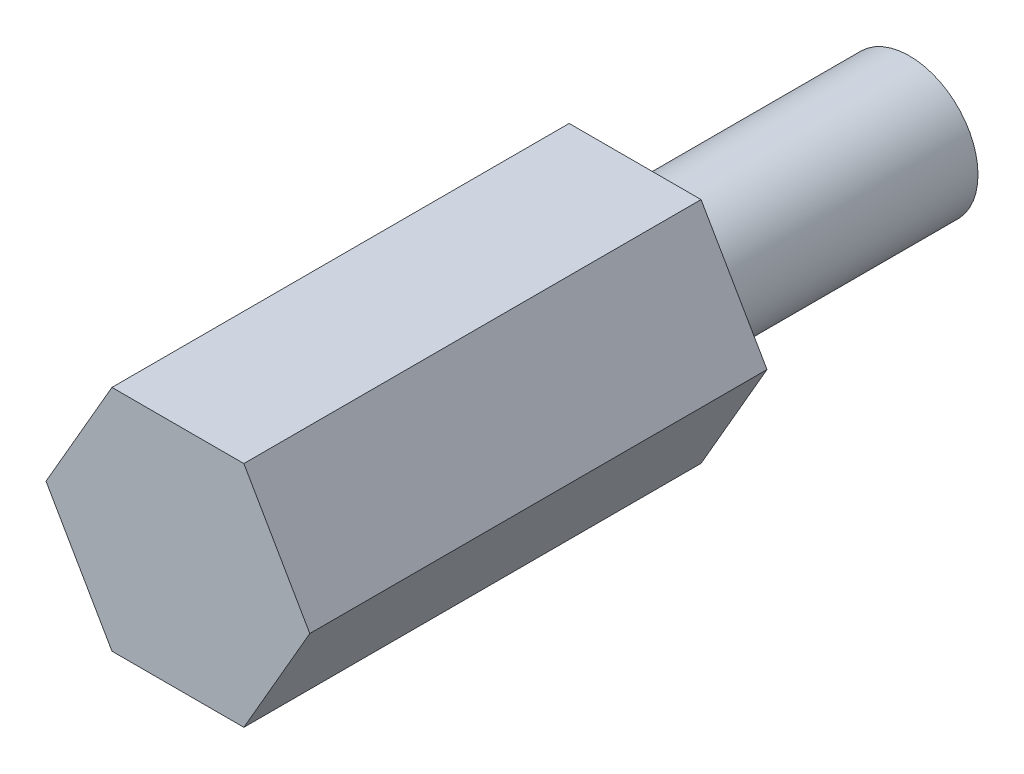
ISO-10303-21;
HEADER;
FILE_DESCRIPTION(('STEP AP214'),'2;1');
FILE_NAME('part.step','',(''),(''),'','','');
FILE_SCHEMA(('AUTOMOTIVE_DESIGN { 1 0 10303 214 1 1 1 1 }'));
ENDSEC;
DATA;
#1=APPLICATION_CONTEXT('core data for automotive mechanical design processes');
#2=APPLICATION_PROTOCOL_DEFINITION('international standard','automotive_design',2000,#1);
#3=PRODUCT_CONTEXT('',#1,'mechanical');
#4=PRODUCT('Part','Part','',(#3));
#5=PRODUCT_RELATED_PRODUCT_CATEGORY('part','',(#4));
#6=PRODUCT_DEFINITION_FORMATION('','',#4);
#7=PRODUCT_DEFINITION_CONTEXT('part definition',#1,'design');
#8=PRODUCT_DEFINITION('design','',#6,#7);
#9=PRODUCT_DEFINITION_SHAPE('','',#8);
#10=(LENGTH_UNIT() NAMED_UNIT(*) SI_UNIT(.MILLI.,.METRE.));
#11=(NAMED_UNIT(*) PLANE_ANGLE_UNIT() SI_UNIT($,.RADIAN.));
#12=(NAMED_UNIT(*) SI_UNIT($,.STERADIAN.) SOLID_ANGLE_UNIT());
#13=UNCERTAINTY_MEASURE_WITH_UNIT(LENGTH_MEASURE(1.E-05),#10,'distance_accuracy_value','');
#14=(GEOMETRIC_REPRESENTATION_CONTEXT(3) GLOBAL_UNCERTAINTY_ASSIGNED_CONTEXT((#13)) GLOBAL_UNIT_ASSIGNED_CONTEXT((#10,
#11,#12)) REPRESENTATION_CONTEXT('',''));
#15=CARTESIAN_POINT('',(0.,0.,0.));
#16=DIRECTION('',(0.,0.,1.));
#17=DIRECTION('',(1.,0.,0.));
#18=AXIS2_PLACEMENT_3D('',#15,#16,#17);
#19=CARTESIAN_POINT('',(36.7933333333333,19.9166666666667,10.));
#20=DIRECTION('',(-0.86602540378444,-0.499999999999998,0.));
#21=DIRECTION('',(0.499999999999998,-0.86602540378444,0.));
#22=AXIS2_PLACEMENT_3D('',#19,#20,#21);
#23=PLANE('',#22);
#24=DIRECTION('',(-0.499999999999999,0.86602540378444,0.));
#25=VECTOR('',#24,1.);
#26=CARTESIAN_POINT('',(36.7933333333333,19.9166666666667,0.));
#27=LINE('',#26,#25);
#28=CARTESIAN_POINT('',(36.7933333333333,19.9166666666667,0.));
#29=VERTEX_POINT('',#28);
#30=CARTESIAN_POINT('',(35.3508333333333,22.4151499565848,0.));
#31=VERTEX_POINT('',#30);
#32=EDGE_CURVE('E117',#29,#31,#27,.T.);
#33=ORIENTED_EDGE('',*,*,#32,.T.);
#34=DIRECTION('',(0.,0.,-1.));
#35=VECTOR('',#34,1.);
#36=CARTESIAN_POINT('',(35.3508333333333,22.4151499565848,10.));
#37=LINE('',#36,#35);
#38=CARTESIAN_POINT('',(35.3508333333333,22.4151499565848,10.));
#39=VERTEX_POINT('',#38);
#40=EDGE_CURVE('E11',#39,#31,#37,.T.);
#41=ORIENTED_EDGE('',*,*,#40,.F.);
#42=DIRECTION('',(-0.499999999999999,0.86602540378444,0.));
#43=VECTOR('',#42,1.);
#44=CARTESIAN_POINT('',(36.7933333333333,19.9166666666667,10.));
#45=LINE('',#44,#43);
#46=CARTESIAN_POINT('',(36.7933333333333,19.9166666666667,10.));
#47=VERTEX_POINT('',#46);
#48=EDGE_CURVE('E128',#47,#39,#45,.T.);
#49=ORIENTED_EDGE('',*,*,#48,.F.);
#50=DIRECTION('',(0.,0.,-1.));
#51=VECTOR('',#50,1.);
#52=CARTESIAN_POINT('',(36.7933333333333,19.9166666666667,10.));
#53=LINE('',#52,#51);
#54=EDGE_CURVE('E113',#47,#29,#53,.T.);
#55=ORIENTED_EDGE('',*,*,#54,.T.);
#56=EDGE_LOOP('',(#33,#41,#49,#55));
#57=FACE_BOUND('',#56,.T.);
#58=ADVANCED_FACE('F33',(#57),#23,.F.);
#59=CARTESIAN_POINT('',(35.3508333333333,22.4151499565848,10.));
#60=DIRECTION('',(0.,-1.,0.));
#61=DIRECTION('',(1.,0.,0.));
#62=AXIS2_PLACEMENT_3D('',#59,#60,#61);
#63=PLANE('',#62);
#64=DIRECTION('',(-1.,0.,0.));
#65=VECTOR('',#64,1.);
#66=CARTESIAN_POINT('',(35.3508333333333,22.4151499565848,0.));
#67=LINE('',#66,#65);
#68=CARTESIAN_POINT('',(32.4658333333333,22.4151499565848,0.));
#69=VERTEX_POINT('',#68);
#70=EDGE_CURVE('E120',#31,#69,#67,.T.);
#71=ORIENTED_EDGE('',*,*,#70,.T.);
#72=DIRECTION('',(0.,0.,-1.));
#73=VECTOR('',#72,1.);
#74=CARTESIAN_POINT('',(32.4658333333333,22.4151499565848,10.));
#75=LINE('',#74,#73);
#76=CARTESIAN_POINT('',(32.4658333333333,22.4151499565848,10.));
#77=VERTEX_POINT('',#76);
#78=EDGE_CURVE('E41',#77,#69,#75,.T.);
#79=ORIENTED_EDGE('',*,*,#78,.F.);
#80=DIRECTION('',(-1.,0.,0.));
#81=VECTOR('',#80,1.);
#82=CARTESIAN_POINT('',(35.3508333333333,22.4151499565848,10.));
#83=LINE('',#82,#81);
#84=EDGE_CURVE('E86',#39,#77,#83,.T.);
#85=ORIENTED_EDGE('',*,*,#84,.F.);
#86=ORIENTED_EDGE('',*,*,#40,.T.);
#87=EDGE_LOOP('',(#71,#79,#85,#86));
#88=FACE_BOUND('',#87,.T.);
#89=ADVANCED_FACE('F152',(#88),#63,.F.);
#90=CARTESIAN_POINT('',(32.4658333333333,22.4151499565848,10.));
#91=DIRECTION('',(0.866025403784438,-0.500000000000002,0.));
#92=DIRECTION('',(0.500000000000002,0.866025403784438,0.));
#93=AXIS2_PLACEMENT_3D('',#90,#91,#92);
#94=PLANE('',#93);
#95=DIRECTION('',(-0.500000000000002,-0.866025403784438,0.));
#96=VECTOR('',#95,1.);
#97=CARTESIAN_POINT('',(32.4658333333333,22.4151499565848,0.));
#98=LINE('',#97,#96);
#99=CARTESIAN_POINT('',(31.0233333333333,19.9166666666667,0.));
#100=VERTEX_POINT('',#99);
#101=EDGE_CURVE('E123',#69,#100,#98,.T.);
#102=ORIENTED_EDGE('',*,*,#101,.T.);
#103=DIRECTION('',(0.,0.,-1.));
#104=VECTOR('',#103,1.);
#105=CARTESIAN_POINT('',(31.0233333333333,19.9166666666667,10.));
#106=LINE('',#105,#104);
#107=CARTESIAN_POINT('',(31.0233333333333,19.9166666666667,10.));
#108=VERTEX_POINT('',#107);
#109=EDGE_CURVE('E108',#108,#100,#106,.T.);
#110=ORIENTED_EDGE('',*,*,#109,.F.);
#111=DIRECTION('',(-0.500000000000002,-0.866025403784438,0.));
#112=VECTOR('',#111,1.);
#113=CARTESIAN_POINT('',(32.4658333333333,22.4151499565848,10.));
#114=LINE('',#113,#112);
#115=EDGE_CURVE('E99',#77,#108,#114,.T.);
#116=ORIENTED_EDGE('',*,*,#115,.F.);
#117=ORIENTED_EDGE('',*,*,#78,.T.);
#118=EDGE_LOOP('',(#102,#110,#116,#117));
#119=FACE_BOUND('',#118,.T.);
#120=ADVANCED_FACE('F134',(#119),#94,.F.);
#121=CARTESIAN_POINT('',(31.0233333333333,19.9166666666667,10.));
#122=DIRECTION('',(0.866025403784438,0.5,0.));
#123=DIRECTION('',(-0.5,0.866025403784439,0.));
#124=AXIS2_PLACEMENT_3D('',#121,#122,#123);
#125=PLANE('',#124);
#126=DIRECTION('',(0.5,-0.866025403784438,0.));
#127=VECTOR('',#126,1.);
#128=CARTESIAN_POINT('',(31.0233333333333,19.9166666666667,0.));
#129=LINE('',#128,#127);
#130=CARTESIAN_POINT('',(32.4658333333333,17.4181833767486,0.));
#131=VERTEX_POINT('',#130);
#132=EDGE_CURVE('E107',#100,#131,#129,.T.);
#133=ORIENTED_EDGE('',*,*,#132,.T.);
#134=DIRECTION('',(0.,0.,-1.));
#135=VECTOR('',#134,1.);
#136=CARTESIAN_POINT('',(32.4658333333333,17.4181833767486,10.));
#137=LINE('',#136,#135);
#138=CARTESIAN_POINT('',(32.4658333333333,17.4181833767486,10.));
#139=VERTEX_POINT('',#138);
#140=EDGE_CURVE('E104',#139,#131,#137,.T.);
#141=ORIENTED_EDGE('',*,*,#140,.F.);
#142=DIRECTION('',(0.5,-0.866025403784438,0.));
#143=VECTOR('',#142,1.);
#144=CARTESIAN_POINT('',(31.0233333333333,19.9166666666667,10.));
#145=LINE('',#144,#143);
#146=EDGE_CURVE('E93',#108,#139,#145,.T.);
#147=ORIENTED_EDGE('',*,*,#146,.F.);
#148=ORIENTED_EDGE('',*,*,#109,.T.);
#149=EDGE_LOOP('',(#133,#141,#147,#148));
#150=FACE_BOUND('',#149,.T.);
#151=ADVANCED_FACE('F105',(#150),#125,.F.);
#152=CARTESIAN_POINT('',(32.4658333333333,17.4181833767486,10.));
#153=DIRECTION('',(0.,1.,0.));
#154=DIRECTION('',(-1.,0.,0.));
#155=AXIS2_PLACEMENT_3D('',#152,#153,#154);
#156=PLANE('',#155);
#157=DIRECTION('',(1.,0.,0.));
#158=VECTOR('',#157,1.);
#159=CARTESIAN_POINT('',(32.4658333333333,17.4181833767486,0.));
#160=LINE('',#159,#158);
#161=CARTESIAN_POINT('',(35.3508333333333,17.4181833767486,0.));
#162=VERTEX_POINT('',#161);
#163=EDGE_CURVE('E72',#131,#162,#160,.T.);
#164=ORIENTED_EDGE('',*,*,#163,.T.);
#165=DIRECTION('',(0.,0.,-1.));
#166=VECTOR('',#165,1.);
#167=CARTESIAN_POINT('',(35.3508333333333,17.4181833767486,10.));
#168=LINE('',#167,#166);
#169=CARTESIAN_POINT('',(35.3508333333333,17.4181833767486,10.));
#170=VERTEX_POINT('',#169);
#171=EDGE_CURVE('E109',#170,#162,#168,.T.);
#172=ORIENTED_EDGE('',*,*,#171,.F.);
#173=DIRECTION('',(1.,0.,0.));
#174=VECTOR('',#173,1.);
#175=CARTESIAN_POINT('',(32.4658333333333,17.4181833767486,10.));
#176=LINE('',#175,#174);
#177=EDGE_CURVE('E97',#139,#170,#176,.T.);
#178=ORIENTED_EDGE('',*,*,#177,.F.);
#179=ORIENTED_EDGE('',*,*,#140,.T.);
#180=EDGE_LOOP('',(#164,#172,#178,#179));
#181=FACE_BOUND('',#180,.T.);
#182=ADVANCED_FACE('F111',(#181),#156,.F.);
#183=CARTESIAN_POINT('',(35.3508333333333,17.4181833767486,10.));
#184=DIRECTION('',(-0.866025403784438,0.500000000000002,0.));
#185=DIRECTION('',(-0.500000000000002,-0.866025403784438,0.));
#186=AXIS2_PLACEMENT_3D('',#183,#184,#185);
#187=PLANE('',#186);
#188=DIRECTION('',(0.500000000000002,0.866025403784438,0.));
#189=VECTOR('',#188,1.);
#190=CARTESIAN_POINT('',(35.3508333333333,17.4181833767486,0.));
#191=LINE('',#190,#189);
#192=EDGE_CURVE('E78',#162,#29,#191,.T.);
#193=ORIENTED_EDGE('',*,*,#192,.T.);
#194=ORIENTED_EDGE('',*,*,#54,.F.);
#195=DIRECTION('',(0.500000000000002,0.866025403784438,0.));
#196=VECTOR('',#195,1.);
#197=CARTESIAN_POINT('',(35.3508333333333,17.4181833767486,10.));
#198=LINE('',#197,#196);
#199=EDGE_CURVE('E49',#170,#47,#198,.T.);
#200=ORIENTED_EDGE('',*,*,#199,.F.);
#201=ORIENTED_EDGE('',*,*,#171,.T.);
#202=EDGE_LOOP('',(#193,#194,#200,#201));
#203=FACE_BOUND('',#202,.T.);
#204=ADVANCED_FACE('F141',(#203),#187,.F.);
#205=CARTESIAN_POINT('',(0.,0.,10.));
#206=DIRECTION('',(0.,0.,1.));
#207=DIRECTION('',(1.,0.,0.));
#208=AXIS2_PLACEMENT_3D('',#205,#206,#207);
#209=PLANE('',#208);
#210=ORIENTED_EDGE('',*,*,#48,.T.);
#211=ORIENTED_EDGE('',*,*,#84,.T.);
#212=ORIENTED_EDGE('',*,*,#115,.T.);
#213=ORIENTED_EDGE('',*,*,#146,.T.);
#214=ORIENTED_EDGE('',*,*,#177,.T.);
#215=ORIENTED_EDGE('',*,*,#199,.T.);
#216=EDGE_LOOP('',(#210,#211,#212,#213,#214,#215));
#217=FACE_BOUND('',#216,.T.);
#218=ADVANCED_FACE('F95',(#217),#209,.T.);
#219=CARTESIAN_POINT('',(0.,0.,0.));
#220=DIRECTION('',(0.,0.,1.));
#221=DIRECTION('',(1.,0.,0.));
#222=AXIS2_PLACEMENT_3D('',#219,#220,#221);
#223=PLANE('',#222);
#224=CARTESIAN_POINT('',(33.9083333333333,19.9166666666667,0.));
#225=DIRECTION('',(0.,0.,1.));
#226=DIRECTION('',(1.,0.,0.));
#227=AXIS2_PLACEMENT_3D('',#224,#225,#226);
#228=CIRCLE('',#227,1.5);
#229=CARTESIAN_POINT('',(35.4083333333333,19.9166666666667,0.));
#230=VERTEX_POINT('',#229);
#231=EDGE_CURVE('E214',#230,#230,#228,.T.);
#232=ORIENTED_EDGE('',*,*,#231,.T.);
#233=EDGE_LOOP('',(#232));
#234=FACE_BOUND('',#233,.T.);
#235=ORIENTED_EDGE('',*,*,#32,.F.);
#236=ORIENTED_EDGE('',*,*,#192,.F.);
#237=ORIENTED_EDGE('',*,*,#163,.F.);
#238=ORIENTED_EDGE('',*,*,#132,.F.);
#239=ORIENTED_EDGE('',*,*,#101,.F.);
#240=ORIENTED_EDGE('',*,*,#70,.F.);
#241=EDGE_LOOP('',(#235,#236,#237,#238,#239,#240));
#242=FACE_BOUND('',#241,.T.);
#243=ADVANCED_FACE('F137',(#234,#242),#223,.F.);
#244=CARTESIAN_POINT('',(33.9083333333333,19.9166666666667,-6.));
#245=DIRECTION('',(0.,0.,1.));
#246=DIRECTION('',(1.,0.,0.));
#247=AXIS2_PLACEMENT_3D('',#244,#245,#246);
#248=CYLINDRICAL_SURFACE('',#247,1.5);
#249=CARTESIAN_POINT('',(33.9083333333333,19.9166666666667,-6.));
#250=DIRECTION('',(0.,0.,1.));
#251=DIRECTION('',(1.,0.,0.));
#252=AXIS2_PLACEMENT_3D('',#249,#250,#251);
#253=CIRCLE('',#252,1.5);
#254=CARTESIAN_POINT('',(35.4083333333333,19.9166666666667,-6.));
#255=VERTEX_POINT('',#254);
#256=EDGE_CURVE('E121',#255,#255,#253,.T.);
#257=ORIENTED_EDGE('',*,*,#256,.T.);
#258=EDGE_LOOP('',(#257));
#259=FACE_BOUND('',#258,.T.);
#260=ORIENTED_EDGE('',*,*,#231,.F.);
#261=EDGE_LOOP('',(#260));
#262=FACE_BOUND('',#261,.T.);
#263=ADVANCED_FACE('F189',(#259,#262),#248,.T.);
#264=CARTESIAN_POINT('',(33.9083333333333,19.9166666666667,-6.));
#265=DIRECTION('',(0.,0.,1.));
#266=DIRECTION('',(1.,0.,0.));
#267=AXIS2_PLACEMENT_3D('',#264,#265,#266);
#268=PLANE('',#267);
#269=ORIENTED_EDGE('',*,*,#256,.F.);
#270=EDGE_LOOP('',(#269));
#271=FACE_BOUND('',#270,.T.);
#272=ADVANCED_FACE('F198',(#271),#268,.F.);
#273=CLOSED_SHELL('',(#58,#89,#120,#151,#182,#204,#218,#243,#263,#272));
#274=MANIFOLD_SOLID_BREP('B2',#273);
#275=ADVANCED_BREP_SHAPE_REPRESENTATION('',(#18,#274),#14);
#276=SHAPE_DEFINITION_REPRESENTATION(#9,#275);
ENDSEC;
END-ISO-10303-21;
